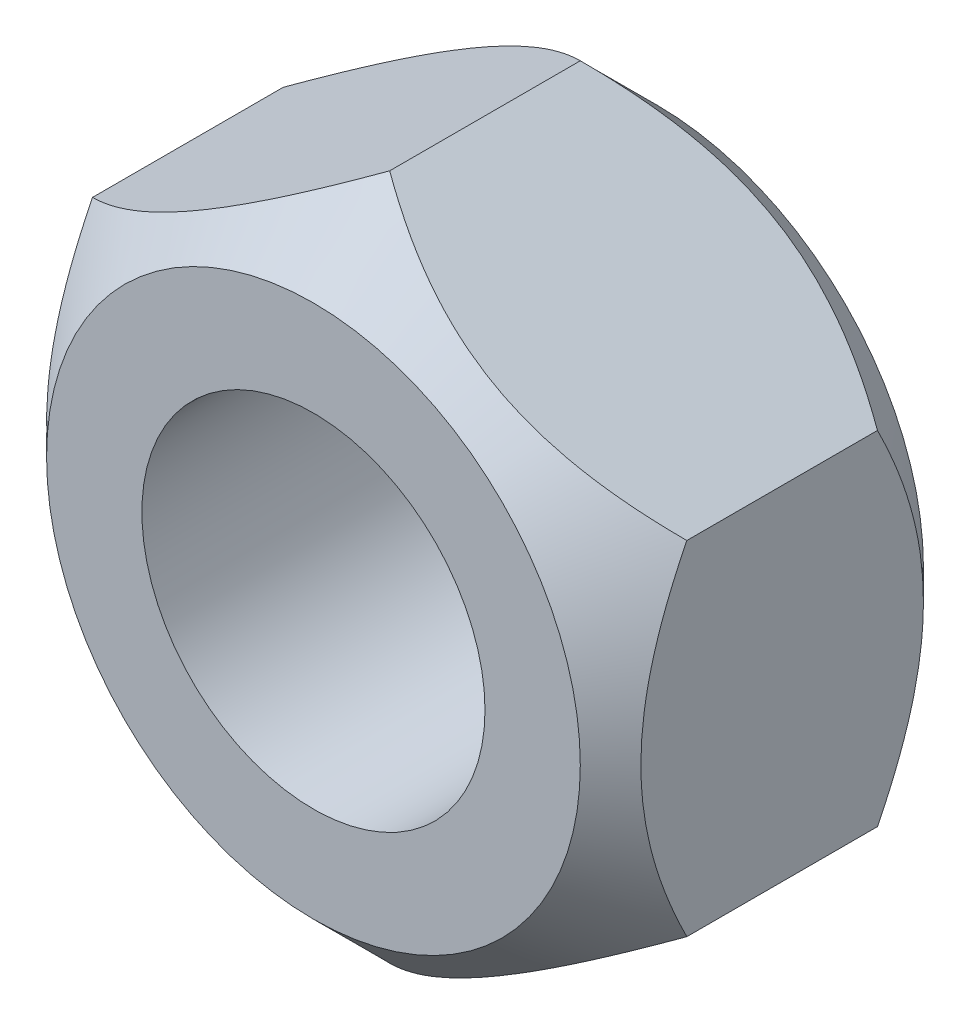
ISO-10303-21;
HEADER;
FILE_DESCRIPTION(('STEP AP214'),'2;1');
FILE_NAME('part.step','',(''),(''),'','','');
FILE_SCHEMA(('AUTOMOTIVE_DESIGN { 1 0 10303 214 1 1 1 1 }'));
ENDSEC;
DATA;
#1=APPLICATION_CONTEXT('core data for automotive mechanical design processes');
#2=APPLICATION_PROTOCOL_DEFINITION('international standard','automotive_design',2000,#1);
#3=PRODUCT_CONTEXT('',#1,'mechanical');
#4=PRODUCT('Part','Part','',(#3));
#5=PRODUCT_RELATED_PRODUCT_CATEGORY('part','',(#4));
#6=PRODUCT_DEFINITION_FORMATION('','',#4);
#7=PRODUCT_DEFINITION_CONTEXT('part definition',#1,'design');
#8=PRODUCT_DEFINITION('design','',#6,#7);
#9=PRODUCT_DEFINITION_SHAPE('','',#8);
#10=(LENGTH_UNIT() NAMED_UNIT(*) SI_UNIT(.MILLI.,.METRE.));
#11=(NAMED_UNIT(*) PLANE_ANGLE_UNIT() SI_UNIT($,.RADIAN.));
#12=(NAMED_UNIT(*) SI_UNIT($,.STERADIAN.) SOLID_ANGLE_UNIT());
#13=UNCERTAINTY_MEASURE_WITH_UNIT(LENGTH_MEASURE(1.E-05),#10,'distance_accuracy_value','');
#14=(GEOMETRIC_REPRESENTATION_CONTEXT(3) GLOBAL_UNCERTAINTY_ASSIGNED_CONTEXT((#13)) GLOBAL_UNIT_ASSIGNED_CONTEXT((#10,
#11,#12)) REPRESENTATION_CONTEXT('',''));
#15=CARTESIAN_POINT('',(0.,0.,0.));
#16=DIRECTION('',(0.,0.,1.));
#17=DIRECTION('',(1.,0.,0.));
#18=AXIS2_PLACEMENT_3D('',#15,#16,#17);
#19=CARTESIAN_POINT('',(0.,0.,-4.5));
#20=DIRECTION('',(0.,0.,1.));
#21=DIRECTION('',(1.,0.,0.));
#22=AXIS2_PLACEMENT_3D('',#19,#20,#21);
#23=PLANE('',#22);
#24=CARTESIAN_POINT('',(0.,0.,-4.5));
#25=DIRECTION('',(0.,0.,1.));
#26=DIRECTION('',(1.,0.,0.));
#27=AXIS2_PLACEMENT_3D('',#24,#25,#26);
#28=CIRCLE('',#27,4.5);
#29=CARTESIAN_POINT('',(4.5,0.,-4.5));
#30=VERTEX_POINT('',#29);
#31=EDGE_CURVE('E206',#30,#30,#28,.T.);
#32=ORIENTED_EDGE('',*,*,#31,.T.);
#33=EDGE_LOOP('',(#32));
#34=FACE_BOUND('',#33,.T.);
#35=CARTESIAN_POINT('',(0.,0.,-4.5));
#36=DIRECTION('',(0.,0.,1.));
#37=DIRECTION('',(1.,0.,0.));
#38=AXIS2_PLACEMENT_3D('',#35,#36,#37);
#39=CIRCLE('',#38,7.);
#40=CARTESIAN_POINT('',(7.,0.,-4.5));
#41=VERTEX_POINT('',#40);
#42=EDGE_CURVE('E99',#41,#41,#39,.T.);
#43=ORIENTED_EDGE('',*,*,#42,.F.);
#44=EDGE_LOOP('',(#43));
#45=FACE_BOUND('',#44,.T.);
#46=ADVANCED_FACE('F35',(#34,#45),#23,.F.);
#47=CARTESIAN_POINT('',(0.,0.,4.5));
#48=DIRECTION('',(0.,0.,1.));
#49=DIRECTION('',(1.,0.,0.));
#50=AXIS2_PLACEMENT_3D('',#47,#48,#49);
#51=PLANE('',#50);
#52=CARTESIAN_POINT('',(0.,0.,4.5));
#53=DIRECTION('',(0.,0.,1.));
#54=DIRECTION('',(1.,0.,0.));
#55=AXIS2_PLACEMENT_3D('',#52,#53,#54);
#56=CIRCLE('',#55,4.5);
#57=CARTESIAN_POINT('',(4.5,0.,4.5));
#58=VERTEX_POINT('',#57);
#59=EDGE_CURVE('E115',#58,#58,#56,.T.);
#60=ORIENTED_EDGE('',*,*,#59,.F.);
#61=EDGE_LOOP('',(#60));
#62=FACE_BOUND('',#61,.T.);
#63=CARTESIAN_POINT('',(0.,0.,4.5));
#64=DIRECTION('',(0.,0.,1.));
#65=DIRECTION('',(1.,0.,0.));
#66=AXIS2_PLACEMENT_3D('',#63,#64,#65);
#67=CIRCLE('',#66,7.);
#68=CARTESIAN_POINT('',(7.,0.,4.5));
#69=VERTEX_POINT('',#68);
#70=EDGE_CURVE('E135',#69,#69,#67,.T.);
#71=ORIENTED_EDGE('',*,*,#70,.T.);
#72=EDGE_LOOP('',(#71));
#73=FACE_BOUND('',#72,.T.);
#74=ADVANCED_FACE('F223',(#62,#73),#51,.T.);
#75=CARTESIAN_POINT('',(0.,-9.,4.5));
#76=DIRECTION('',(-0.5,0.866025403784439,0.));
#77=DIRECTION('',(-0.866025403784439,-0.5,0.));
#78=AXIS2_PLACEMENT_3D('',#75,#76,#77);
#79=PLANE('',#78);
#80=DIRECTION('',(0.,0.,-1.));
#81=VECTOR('',#80,1.);
#82=CARTESIAN_POINT('',(0.,-9.,4.5));
#83=LINE('',#82,#81);
#84=CARTESIAN_POINT('',(0.,-9.,2.50000000000001));
#85=VERTEX_POINT('',#84);
#86=CARTESIAN_POINT('',(0.,-9.,-2.50000000000001));
#87=VERTEX_POINT('',#86);
#88=EDGE_CURVE('E111',#85,#87,#83,.T.);
#89=ORIENTED_EDGE('',*,*,#88,.T.);
#90=CARTESIAN_POINT('',(-0.000200000000004424,-9.00011547005384,-2.49988452772398));
#91=CARTESIAN_POINT('',(0.133814912829303,-8.92274192405641,-2.57724943822116));
#92=CARTESIAN_POINT('',(0.268859920219695,-8.84477365268685,-2.65224010470585));
#93=CARTESIAN_POINT('',(0.541212204700916,-8.68753098792721,-2.79675072757461));
#94=CARTESIAN_POINT('',(0.678520668512916,-8.60825590938334,-2.8662676961683));
#95=CARTESIAN_POINT('',(1.09541992231467,-8.36755901297594,-3.06611750189364));
#96=CARTESIAN_POINT('',(1.37853991488369,-8.20409960905325,-3.18689671096131));
#97=CARTESIAN_POINT('',(1.94947397801178,-7.87447067401672,-3.39372263743866));
#98=CARTESIAN_POINT('',(2.23714213096899,-7.7083853884696,-3.48029040430474));
#99=CARTESIAN_POINT('',(2.67337358843079,-7.45652703907504,-3.58042793344483));
#100=CARTESIAN_POINT('',(2.81942630960118,-7.37220346119144,-3.60884136548566));
#101=CARTESIAN_POINT('',(3.11276835521759,-7.20284235219017,-3.65512056900799));
#102=CARTESIAN_POINT('',(3.26005749153017,-7.1178049296914,-3.67298791670453));
#103=CARTESIAN_POINT('',(3.61898351870672,-6.91057889128185,-3.70294525162354));
#104=CARTESIAN_POINT('',(3.83100714223217,-6.78816699516487,-3.70923068335258));
#105=CARTESIAN_POINT('',(4.25467221995019,-6.54356384849813,-3.69867971969579));
#106=CARTESIAN_POINT('',(4.46631351414594,-6.42137269032257,-3.68183521936724));
#107=CARTESIAN_POINT('',(4.88760075151282,-6.17814239042265,-3.62601731093405));
#108=CARTESIAN_POINT('',(5.09724419637851,-6.05710469109561,-3.58701915721181));
#109=CARTESIAN_POINT('',(5.5129278162872,-5.81710964124361,-3.48901412107609));
#110=CARTESIAN_POINT('',(5.718968266362,-5.69815213192897,-3.43000877296915));
#111=CARTESIAN_POINT('',(6.08472164618569,-5.48698431963075,-3.3086185274243));
#112=CARTESIAN_POINT('',(6.24524456927916,-5.39430636677162,-3.24942654058235));
#113=CARTESIAN_POINT('',(6.56340893558358,-5.21061408423922,-3.12150426182083));
#114=CARTESIAN_POINT('',(6.72105029135445,-5.11959980504949,-3.05277368099819));
#115=CARTESIAN_POINT('',(7.03295499774781,-4.93952153885177,-2.90731482672895));
#116=CARTESIAN_POINT('',(7.18722721899938,-4.8504524303837,-2.83061170476549));
#117=CARTESIAN_POINT('',(7.49291506794184,-4.67396346850877,-2.67021472494556));
#118=CARTESIAN_POINT('',(7.64433237841887,-4.58654264354489,-2.58652515379038));
#119=CARTESIAN_POINT('',(7.79442863405994,-4.49988452994616,-2.49988452772398));
#120=B_SPLINE_CURVE_WITH_KNOTS('',3,(#90,#91,#92,#93,#94,#95,#96,#97,#98,#99,#100,#101,#102,
#103,#104,#105,#106,#107,#108,#109,#110,#111,#112,#113,#114,#115,#116,#117,#118,#119),
.UNSPECIFIED.,.F.,.F.,(4,2,2,2,2,2,2,2,2,2,2,2,2,2,4),(0.,0.518995570787867,1.03827249662172,
2.08243235310214,3.11001247476867,3.62279481108642,4.13550048766921,4.86907230716034,
5.60290124262732,6.33755148088632,7.07214539321498,7.65560480846296,8.23908189927372,
8.82077112592717,9.40210603032025),.UNSPECIFIED.);
#121=CARTESIAN_POINT('',(7.79422863405995,-4.5,-2.50000000000001));
#122=VERTEX_POINT('',#121);
#123=EDGE_CURVE('E56',#87,#122,#120,.T.);
#124=ORIENTED_EDGE('',*,*,#123,.T.);
#125=DIRECTION('',(0.,0.,-1.));
#126=VECTOR('',#125,1.);
#127=CARTESIAN_POINT('',(7.79422863405995,-4.5,4.5));
#128=LINE('',#127,#126);
#129=CARTESIAN_POINT('',(7.79422863405995,-4.5,2.50000000000001));
#130=VERTEX_POINT('',#129);
#131=EDGE_CURVE('E49',#130,#122,#128,.T.);
#132=ORIENTED_EDGE('',*,*,#131,.F.);
#133=CARTESIAN_POINT('',(-0.000200000000004337,-9.00011547005384,2.49988452772398));
#134=CARTESIAN_POINT('',(0.133814912829303,-8.92274192405641,2.57724943822116));
#135=CARTESIAN_POINT('',(0.268859920219695,-8.84477365268685,2.65224010470585));
#136=CARTESIAN_POINT('',(0.541212204700916,-8.68753098792721,2.79675072757461));
#137=CARTESIAN_POINT('',(0.678520668512916,-8.60825590938334,2.8662676961683));
#138=CARTESIAN_POINT('',(1.09541992231467,-8.36755901297594,3.06611750189364));
#139=CARTESIAN_POINT('',(1.37853991488369,-8.20409960905325,3.18689671096131));
#140=CARTESIAN_POINT('',(1.94947397801178,-7.87447067401672,3.39372263743866));
#141=CARTESIAN_POINT('',(2.23714213096899,-7.7083853884696,3.48029040430474));
#142=CARTESIAN_POINT('',(2.67337358843079,-7.45652703907504,3.58042793344483));
#143=CARTESIAN_POINT('',(2.81942630960118,-7.37220346119144,3.60884136548566));
#144=CARTESIAN_POINT('',(3.11276835521759,-7.20284235219017,3.65512056900799));
#145=CARTESIAN_POINT('',(3.26005749153017,-7.1178049296914,3.67298791670453));
#146=CARTESIAN_POINT('',(3.61898351870672,-6.91057889128185,3.70294525162354));
#147=CARTESIAN_POINT('',(3.83100714223217,-6.78816699516487,3.70923068335258));
#148=CARTESIAN_POINT('',(4.25467221995019,-6.54356384849813,3.69867971969579));
#149=CARTESIAN_POINT('',(4.46631351414594,-6.42137269032258,3.68183521936724));
#150=CARTESIAN_POINT('',(4.88760075151282,-6.17814239042265,3.62601731093405));
#151=CARTESIAN_POINT('',(5.0972441963785,-6.05710469109561,3.58701915721182));
#152=CARTESIAN_POINT('',(5.5129278162872,-5.81710964124361,3.48901412107609));
#153=CARTESIAN_POINT('',(5.718968266362,-5.69815213192897,3.43000877296915));
#154=CARTESIAN_POINT('',(6.08472164618568,-5.48698431963075,3.3086185274243));
#155=CARTESIAN_POINT('',(6.24524456927916,-5.39430636677163,3.24942654058235));
#156=CARTESIAN_POINT('',(6.56340893558358,-5.21061408423922,3.12150426182083));
#157=CARTESIAN_POINT('',(6.72105029135445,-5.11959980504949,3.05277368099819));
#158=CARTESIAN_POINT('',(7.03295499774781,-4.93952153885178,2.90731482672895));
#159=CARTESIAN_POINT('',(7.18722721899938,-4.8504524303837,2.83061170476549));
#160=CARTESIAN_POINT('',(7.49291506794184,-4.67396346850877,2.67021472494557));
#161=CARTESIAN_POINT('',(7.64433237841887,-4.58654264354489,2.58652515379038));
#162=CARTESIAN_POINT('',(7.79442863405994,-4.49988452994616,2.49988452772398));
#163=B_SPLINE_CURVE_WITH_KNOTS('',3,(#133,#134,#135,#136,#137,#138,#139,#140,#141,#142,#143,
#144,#145,#146,#147,#148,#149,#150,#151,#152,#153,#154,#155,#156,#157,#158,#159,#160,#161,#162),
.UNSPECIFIED.,.F.,.F.,(4,2,2,2,2,2,2,2,2,2,2,2,2,2,4),(0.,0.518995570787867,1.03827249662172,
2.08243235310213,3.11001247476867,3.62279481108641,4.13550048766921,4.86907230716034,
5.60290124262732,6.33755148088631,7.07214539321497,7.65560480846295,8.23908189927372,
8.82077112592717,9.40210603032024),.UNSPECIFIED.);
#164=EDGE_CURVE('E134',#85,#130,#163,.T.);
#165=ORIENTED_EDGE('',*,*,#164,.F.);
#166=EDGE_LOOP('',(#89,#124,#132,#165));
#167=FACE_BOUND('',#166,.T.);
#168=ADVANCED_FACE('F37',(#167),#79,.F.);
#169=CARTESIAN_POINT('',(7.79422863405995,-4.5,4.5));
#170=DIRECTION('',(-1.,0.,0.));
#171=DIRECTION('',(0.,0.,1.));
#172=AXIS2_PLACEMENT_3D('',#169,#170,#171);
#173=PLANE('',#172);
#174=ORIENTED_EDGE('',*,*,#131,.T.);
#175=CARTESIAN_POINT('',(7.79422863405995,-9.09394715547472,0.477056185330612));
#176=CARTESIAN_POINT('',(7.79422863405995,-8.87304824034257,0.309369922337286));
#177=CARTESIAN_POINT('',(7.79422863405995,-8.65092594028398,0.143269304135814));
#178=CARTESIAN_POINT('',(7.79422863405995,-8.2037468853519,-0.185046465831498));
#179=CARTESIAN_POINT('',(7.79422863405995,-7.9786894198651,-0.347260648660207));
#180=CARTESIAN_POINT('',(7.79422863405995,-7.52350587516484,-0.668243492062624));
#181=CARTESIAN_POINT('',(7.79422863405995,-7.29335404542553,-0.826975758505599));
#182=CARTESIAN_POINT('',(7.79422863405995,-6.82916491800423,-1.13863473603327));
#183=CARTESIAN_POINT('',(7.79422863405995,-6.59512789431531,-1.29156185403188));
#184=CARTESIAN_POINT('',(7.79422863405995,-6.10861356811196,-1.59911373195837));
#185=CARTESIAN_POINT('',(7.79422863405995,-5.85586236287458,-1.75330739987037));
#186=CARTESIAN_POINT('',(7.79422863405995,-5.34444805225407,-2.05172051396913));
#187=CARTESIAN_POINT('',(7.79422863405995,-5.0857840022399,-2.19593835139815));
#188=CARTESIAN_POINT('',(7.79422863405995,-4.56254060285832,-2.47129952018685));
#189=CARTESIAN_POINT('',(7.79422863405995,-4.29798164154792,-2.60248128979954));
#190=CARTESIAN_POINT('',(7.79422863405995,-3.76157041279732,-2.84883273993489));
#191=CARTESIAN_POINT('',(7.79422863405995,-3.48972155704628,-2.96400975992128));
#192=CARTESIAN_POINT('',(7.79422863405995,-2.96195558134773,-3.16519743759073));
#193=CARTESIAN_POINT('',(7.79422863405995,-2.70667616130689,-3.2528637124236));
#194=CARTESIAN_POINT('',(7.79422863405995,-2.18986711745022,-3.40773189086697));
#195=CARTESIAN_POINT('',(7.79422863405995,-1.92833707431502,-3.47493241736553));
#196=CARTESIAN_POINT('',(7.79422863405995,-1.40499627685955,-3.58420542834552));
#197=CARTESIAN_POINT('',(7.79422863405995,-1.14327848116194,-3.62671579796499));
#198=CARTESIAN_POINT('',(7.79422863405995,-0.616913524311271,-3.68576445338113));
#199=CARTESIAN_POINT('',(7.79422863405995,-0.352266903985001,-3.7023074562197));
#200=CARTESIAN_POINT('',(7.79422863405995,0.167194170703069,-3.70813991339629));
#201=CARTESIAN_POINT('',(7.79422863405995,0.421997492259029,-3.69844765895442));
#202=CARTESIAN_POINT('',(7.79422863405995,0.929479250449245,-3.65462007372973));
#203=CARTESIAN_POINT('',(7.79422863405995,1.1821574819346,-3.62048240986263));
#204=CARTESIAN_POINT('',(7.79422863405995,1.6878345517575,-3.52906544661772));
#205=CARTESIAN_POINT('',(7.79422863405995,1.94076025751878,-3.47138813734577));
#206=CARTESIAN_POINT('',(7.79422863405995,2.44108523216263,-3.33600336789197));
#207=CARTESIAN_POINT('',(7.79422863405995,2.68848492023637,-3.25829743268213));
#208=CARTESIAN_POINT('',(7.79422863405995,3.19749234060817,-3.07903876024062));
#209=CARTESIAN_POINT('',(7.79422863405995,3.45858810167663,-2.97604743571423));
#210=CARTESIAN_POINT('',(7.79422863405995,3.97401946723936,-2.7542202202052));
#211=CARTESIAN_POINT('',(7.79422863405995,4.22835188870413,-2.6353770217755));
#212=CARTESIAN_POINT('',(7.79422863405995,4.73148608186761,-2.38467036528707));
#213=CARTESIAN_POINT('',(7.79422863405995,4.98026743549242,-2.25276626146364));
#214=CARTESIAN_POINT('',(7.79422863405995,5.47211299031114,-1.97884924330837));
#215=CARTESIAN_POINT('',(7.79422863405995,5.71517808362128,-1.83683792049101));
#216=CARTESIAN_POINT('',(7.79422863405995,6.18440751626233,-1.55193963216556));
#217=CARTESIAN_POINT('',(7.79422863405995,6.41081191650821,-1.40944596144392));
#218=CARTESIAN_POINT('',(7.79422863405995,6.85973281578872,-1.11844233782494));
#219=CARTESIAN_POINT('',(7.79422863405995,7.08224901939772,-0.969931930595725));
#220=CARTESIAN_POINT('',(7.79422863405995,7.52210265451289,-0.66919058507346));
#221=CARTESIAN_POINT('',(7.79422863405995,7.73946742483206,-0.516999488151345));
#222=CARTESIAN_POINT('',(7.79422863405995,8.17122258952744,-0.208574446056027));
#223=CARTESIAN_POINT('',(7.79422863405995,8.38561378614921,-0.0523416252313317));
#224=CARTESIAN_POINT('',(7.79422863405995,8.59875908665108,0.105544271177639));
#225=B_SPLINE_CURVE_WITH_KNOTS('',3,(#175,#176,#177,#178,#179,#180,#181,#182,#183,#184,#185,
#186,#187,#188,#189,#190,#191,#192,#193,#194,#195,#196,#197,#198,#199,#200,#201,#202,#203,#204,
#205,#206,#207,#208,#209,#210,#211,#212,#213,#214,#215,#216,#217,#218,#219,#220,#221,#222,#223,
#224),.UNSPECIFIED.,.F.,.F.,(4,2,2,2,2,2,2,2,2,2,2,2,2,2,2,2,2,2,2,2,2,2,2,2,4),(0.,
0.832022793264551,1.66425090601205,2.50292157170978,3.34153334152934,4.22956744022142,
5.11774441594441,6.0032195454111,6.88828726377758,7.69731860709993,8.50640437700199,
9.30066436115751,10.0947800491506,10.8585193930986,11.6223316384961,12.3996319486262,
13.1768730928778,14.0182445381844,14.8600051907364,15.7044730667065,16.5488082630534,
17.3512366611706,18.1537257650846,18.9497197770996,19.7454946871066),.UNSPECIFIED.);
#226=CARTESIAN_POINT('',(7.79422863405995,4.5,-2.50000000000001));
#227=VERTEX_POINT('',#226);
#228=EDGE_CURVE('E130',#122,#227,#225,.T.);
#229=ORIENTED_EDGE('',*,*,#228,.T.);
#230=DIRECTION('',(0.,0.,-1.));
#231=VECTOR('',#230,1.);
#232=CARTESIAN_POINT('',(7.79422863405995,4.5,4.5));
#233=LINE('',#232,#231);
#234=CARTESIAN_POINT('',(7.79422863405995,4.5,2.50000000000001));
#235=VERTEX_POINT('',#234);
#236=EDGE_CURVE('E121',#235,#227,#233,.T.);
#237=ORIENTED_EDGE('',*,*,#236,.F.);
#238=CARTESIAN_POINT('',(7.79422863405995,-9.11863627866827,-0.49581291879149));
#239=CARTESIAN_POINT('',(7.79422863405995,-8.89724376305625,-0.327559158709732));
#240=CARTESIAN_POINT('',(7.79422863405995,-8.67462790699453,-0.160889222300111));
#241=CARTESIAN_POINT('',(7.79422863405995,-8.22646080065647,0.168568779647738));
#242=CARTESIAN_POINT('',(7.79422863405995,-8.00090884202403,0.331355880550955));
#243=CARTESIAN_POINT('',(7.79422863405995,-7.54473075560588,0.653492298004572));
#244=CARTESIAN_POINT('',(7.79422863405995,-7.31407886663682,0.812805256213386));
#245=CARTESIAN_POINT('',(7.79422863405995,-6.84888563683663,1.12562871650273));
#246=CARTESIAN_POINT('',(7.79422863405995,-6.6143445698453,1.27913962463481));
#247=CARTESIAN_POINT('',(7.79422863405995,-6.12669801100064,1.5879508601926));
#248=CARTESIAN_POINT('',(7.79422863405995,-5.87331643820808,1.7428174306828));
#249=CARTESIAN_POINT('',(7.79422863405995,-5.36062431926778,2.04256769064756));
#250=CARTESIAN_POINT('',(7.79422863405995,-5.10131282234181,2.18744976409159));
#251=CARTESIAN_POINT('',(7.79422863405995,-4.57675177345508,2.46411886174421));
#252=CARTESIAN_POINT('',(7.79422863405995,-4.31152268558148,2.59594438187719));
#253=CARTESIAN_POINT('',(7.79422863405995,-3.77373677628115,2.84354820712139));
#254=CARTESIAN_POINT('',(7.79422863405995,-3.50118339127063,2.95933388611422));
#255=CARTESIAN_POINT('',(7.79422863405995,-2.97232992335846,3.16151116397044));
#256=CARTESIAN_POINT('',(7.79422863405995,-2.71667916441184,3.24958378601871));
#257=CARTESIAN_POINT('',(7.79422863405995,-2.19909692605669,3.40523788735144));
#258=CARTESIAN_POINT('',(7.79422863405995,-1.93716502727825,3.47281799428829));
#259=CARTESIAN_POINT('',(7.79422863405995,-1.41301128174397,3.58278938552872));
#260=CARTESIAN_POINT('',(7.79422863405995,-1.15088339820741,3.62562114650901));
#261=CARTESIAN_POINT('',(7.79422863405995,-0.623666543696004,3.68524160940488));
#262=CARTESIAN_POINT('',(7.79422863405995,-0.358578125624287,3.70203509488474));
#263=CARTESIAN_POINT('',(7.79422863405995,0.161655582537087,3.70826718171898));
#264=CARTESIAN_POINT('',(7.79422863405995,0.416788791328765,3.69873892078228));
#265=CARTESIAN_POINT('',(7.79422863405995,0.924939337840435,3.65516781717527));
#266=CARTESIAN_POINT('',(7.79422863405995,1.17795647205576,3.62112264350477));
#267=CARTESIAN_POINT('',(7.79422863405995,1.68432417774725,3.52981967956849));
#268=CARTESIAN_POINT('',(7.79422863405995,1.93760141924557,3.47216178368508));
#269=CARTESIAN_POINT('',(7.79422863405995,2.43861843577759,3.33675115618934));
#270=CARTESIAN_POINT('',(7.79422863405995,2.68635862216585,3.25899992276302));
#271=CARTESIAN_POINT('',(7.79422863405995,3.19552545298942,3.07978118806223));
#272=CARTESIAN_POINT('',(7.79422863405995,3.45645287453228,2.97691027579791));
#273=CARTESIAN_POINT('',(7.79422863405995,3.97155614606763,2.75533602046274));
#274=CARTESIAN_POINT('',(7.79422863405995,4.22572882355011,2.63662539018871));
#275=CARTESIAN_POINT('',(7.79422863405995,4.72854871011536,2.38619224839543));
#276=CARTESIAN_POINT('',(7.79422863405995,4.97717554762213,2.25442916490132));
#277=CARTESIAN_POINT('',(7.79422863405995,5.46871717061556,1.98079866286188));
#278=CARTESIAN_POINT('',(7.79422863405995,5.71163284564515,1.83893283192657));
#279=CARTESIAN_POINT('',(7.79422863405995,6.18058060030463,1.55431707414972));
#280=CARTESIAN_POINT('',(7.79422863405995,6.40685244588674,1.41196011259217));
#281=CARTESIAN_POINT('',(7.79422863405995,6.85551031235278,1.12123100261908));
#282=CARTESIAN_POINT('',(7.79422863405995,7.07789603815161,0.972858400233066));
#283=CARTESIAN_POINT('',(7.79422863405995,7.51749251053286,0.672391168670841));
#284=CARTESIAN_POINT('',(7.79422863405995,7.73473056455643,0.520336348130769));
#285=CARTESIAN_POINT('',(7.79422863405995,8.1662332947553,0.212183967746507));
#286=CARTESIAN_POINT('',(7.79422863405995,8.38049877304376,0.0560875324024104));
#287=CARTESIAN_POINT('',(7.79422863405995,8.59351863403874,-0.101662058238496));
#288=B_SPLINE_CURVE_WITH_KNOTS('',3,(#238,#239,#240,#241,#242,#243,#244,#245,#246,#247,#248,
#249,#250,#251,#252,#253,#254,#255,#256,#257,#258,#259,#260,#261,#262,#263,#264,#265,#266,#267,
#268,#269,#270,#271,#272,#273,#274,#275,#276,#277,#278,#279,#280,#281,#282,#283,#284,#285,#286,
#287),.UNSPECIFIED.,.F.,.F.,(4,2,2,2,2,2,2,2,2,2,2,2,2,2,2,2,2,2,2,2,2,2,2,2,4),(0.,
0.834231738401029,1.66866861543129,2.5095637126134,3.35039985108581,4.24110012959546,
5.13194423453569,6.02007828309381,6.90780267146998,7.71828351476771,8.52881862255801,
9.32444408797799,10.1199233694967,10.8846281318961,11.6494056099085,12.4277164632134,
13.205969301359,14.0467395241653,14.8878978931083,15.7317582373753,16.5754862634477,
17.3773596551058,18.1792936732027,18.9747417826645,19.7699709033892),.UNSPECIFIED.);
#289=EDGE_CURVE('E131',#130,#235,#288,.T.);
#290=ORIENTED_EDGE('',*,*,#289,.F.);
#291=EDGE_LOOP('',(#174,#229,#237,#290));
#292=FACE_BOUND('',#291,.T.);
#293=ADVANCED_FACE('F128',(#292),#173,.F.);
#294=CARTESIAN_POINT('',(7.79422863405995,4.5,4.5));
#295=DIRECTION('',(-0.5,-0.866025403784439,0.));
#296=DIRECTION('',(0.866025403784439,-0.5,0.));
#297=AXIS2_PLACEMENT_3D('',#294,#295,#296);
#298=PLANE('',#297);
#299=ORIENTED_EDGE('',*,*,#236,.T.);
#300=CARTESIAN_POINT('',(7.79442863405995,4.49988452994616,-2.49988452772398));
#301=CARTESIAN_POINT('',(7.66041372123064,4.57725807594359,-2.57724943822116));
#302=CARTESIAN_POINT('',(7.52536871384025,4.65522634731315,-2.65224010470585));
#303=CARTESIAN_POINT('',(7.25301642935903,4.81246901207279,-2.79675072757461));
#304=CARTESIAN_POINT('',(7.11570796554703,4.89174409061666,-2.8662676961683));
#305=CARTESIAN_POINT('',(6.69880871174527,5.13244098702406,-3.06611750189364));
#306=CARTESIAN_POINT('',(6.41568871917625,5.29590039094675,-3.18689671096131));
#307=CARTESIAN_POINT('',(5.84475465604816,5.62552932598328,-3.39372263743866));
#308=CARTESIAN_POINT('',(5.55708650309095,5.79161461153041,-3.48029040430474));
#309=CARTESIAN_POINT('',(5.12085504562915,6.04347296092496,-3.58042793344483));
#310=CARTESIAN_POINT('',(4.97480232445876,6.12779653880856,-3.60884136548566));
#311=CARTESIAN_POINT('',(4.68146027884235,6.29715764780983,-3.65512056900799));
#312=CARTESIAN_POINT('',(4.53417114252977,6.38219507030861,-3.67298791670453));
#313=CARTESIAN_POINT('',(4.17524511535322,6.58942110871815,-3.70294525162354));
#314=CARTESIAN_POINT('',(3.96322149182777,6.71183300483513,-3.70923068335258));
#315=CARTESIAN_POINT('',(3.53955641410975,6.95643615150187,-3.69867971969579));
#316=CARTESIAN_POINT('',(3.327915119914,7.07862730967743,-3.68183521936724));
#317=CARTESIAN_POINT('',(2.90662788254712,7.32185760957735,-3.62601731093404));
#318=CARTESIAN_POINT('',(2.69698443768143,7.44289530890439,-3.58701915721181));
#319=CARTESIAN_POINT('',(2.28130081777274,7.6828903587564,-3.48901412107608));
#320=CARTESIAN_POINT('',(2.07526036769793,7.80184786807104,-3.43000877296914));
#321=CARTESIAN_POINT('',(1.70950698787425,8.01301568036926,-3.30861852742429));
#322=CARTESIAN_POINT('',(1.54898406478078,8.10569363322838,-3.24942654058234));
#323=CARTESIAN_POINT('',(1.23081969847636,8.28938591576078,-3.12150426182083));
#324=CARTESIAN_POINT('',(1.07317834270549,8.38040019495051,-3.05277368099818));
#325=CARTESIAN_POINT('',(0.76127363631213,8.56047846114823,-2.90731482672894));
#326=CARTESIAN_POINT('',(0.607001415060562,8.6495475696163,-2.83061170476548));
#327=CARTESIAN_POINT('',(0.301313566118107,8.82603653149123,-2.67021472494556));
#328=CARTESIAN_POINT('',(0.149896255641076,8.91345735645511,-2.58652515379037));
#329=CARTESIAN_POINT('',(-0.000199999999998226,9.00011547005384,-2.49988452772397));
#330=B_SPLINE_CURVE_WITH_KNOTS('',3,(#300,#301,#302,#303,#304,#305,#306,#307,#308,#309,#310,
#311,#312,#313,#314,#315,#316,#317,#318,#319,#320,#321,#322,#323,#324,#325,#326,#327,#328,#329),
.UNSPECIFIED.,.F.,.F.,(4,2,2,2,2,2,2,2,2,2,2,2,2,2,4),(0.,0.518995570787867,1.03827249662172,
2.08243235310214,3.11001247476867,3.62279481108642,4.13550048766921,4.86907230716034,
5.60290124262733,6.33755148088632,7.07214539321498,7.65560480846296,8.23908189927372,
8.82077112592717,9.40210603032024),.UNSPECIFIED.);
#331=CARTESIAN_POINT('',(0.,9.,-2.50000000000001));
#332=VERTEX_POINT('',#331);
#333=EDGE_CURVE('E139',#227,#332,#330,.T.);
#334=ORIENTED_EDGE('',*,*,#333,.T.);
#335=DIRECTION('',(0.,0.,-1.));
#336=VECTOR('',#335,1.);
#337=CARTESIAN_POINT('',(0.,9.,4.5));
#338=LINE('',#337,#336);
#339=CARTESIAN_POINT('',(0.,9.,2.50000000000001));
#340=VERTEX_POINT('',#339);
#341=EDGE_CURVE('E113',#340,#332,#338,.T.);
#342=ORIENTED_EDGE('',*,*,#341,.F.);
#343=CARTESIAN_POINT('',(7.79442863405995,4.49988452994616,2.49988452772398));
#344=CARTESIAN_POINT('',(7.66041372123064,4.57725807594359,2.57724943822116));
#345=CARTESIAN_POINT('',(7.52536871384025,4.65522634731315,2.65224010470585));
#346=CARTESIAN_POINT('',(7.25301642935903,4.81246901207279,2.79675072757461));
#347=CARTESIAN_POINT('',(7.11570796554703,4.89174409061666,2.8662676961683));
#348=CARTESIAN_POINT('',(6.69880871174527,5.13244098702406,3.06611750189364));
#349=CARTESIAN_POINT('',(6.41568871917625,5.29590039094675,3.18689671096131));
#350=CARTESIAN_POINT('',(5.84475465604816,5.62552932598328,3.39372263743866));
#351=CARTESIAN_POINT('',(5.55708650309095,5.79161461153041,3.48029040430474));
#352=CARTESIAN_POINT('',(5.12085504562915,6.04347296092496,3.58042793344483));
#353=CARTESIAN_POINT('',(4.97480232445876,6.12779653880856,3.60884136548566));
#354=CARTESIAN_POINT('',(4.68146027884235,6.29715764780983,3.65512056900799));
#355=CARTESIAN_POINT('',(4.53417114252977,6.38219507030861,3.67298791670453));
#356=CARTESIAN_POINT('',(4.17524511535322,6.58942110871815,3.70294525162354));
#357=CARTESIAN_POINT('',(3.96322149182777,6.71183300483513,3.70923068335258));
#358=CARTESIAN_POINT('',(3.53955641410975,6.95643615150187,3.69867971969579));
#359=CARTESIAN_POINT('',(3.327915119914,7.07862730967743,3.68183521936724));
#360=CARTESIAN_POINT('',(2.90662788254712,7.32185760957735,3.62601731093404));
#361=CARTESIAN_POINT('',(2.69698443768143,7.44289530890439,3.58701915721181));
#362=CARTESIAN_POINT('',(2.28130081777274,7.6828903587564,3.48901412107608));
#363=CARTESIAN_POINT('',(2.07526036769793,7.80184786807104,3.43000877296914));
#364=CARTESIAN_POINT('',(1.70950698787425,8.01301568036926,3.30861852742429));
#365=CARTESIAN_POINT('',(1.54898406478078,8.10569363322838,3.24942654058234));
#366=CARTESIAN_POINT('',(1.23081969847636,8.28938591576078,3.12150426182083));
#367=CARTESIAN_POINT('',(1.07317834270549,8.38040019495051,3.05277368099818));
#368=CARTESIAN_POINT('',(0.76127363631213,8.56047846114823,2.90731482672894));
#369=CARTESIAN_POINT('',(0.607001415060562,8.6495475696163,2.83061170476548));
#370=CARTESIAN_POINT('',(0.301313566118107,8.82603653149123,2.67021472494556));
#371=CARTESIAN_POINT('',(0.149896255641076,8.91345735645511,2.58652515379037));
#372=CARTESIAN_POINT('',(-0.000199999999998226,9.00011547005384,2.49988452772397));
#373=B_SPLINE_CURVE_WITH_KNOTS('',3,(#343,#344,#345,#346,#347,#348,#349,#350,#351,#352,#353,
#354,#355,#356,#357,#358,#359,#360,#361,#362,#363,#364,#365,#366,#367,#368,#369,#370,#371,#372),
.UNSPECIFIED.,.F.,.F.,(4,2,2,2,2,2,2,2,2,2,2,2,2,2,4),(0.,0.518995570787867,1.03827249662172,
2.08243235310214,3.11001247476867,3.62279481108642,4.13550048766921,4.86907230716034,
5.60290124262733,6.33755148088632,7.07214539321498,7.65560480846296,8.23908189927372,
8.82077112592717,9.40210603032024),.UNSPECIFIED.);
#374=EDGE_CURVE('E188',#235,#340,#373,.T.);
#375=ORIENTED_EDGE('',*,*,#374,.F.);
#376=EDGE_LOOP('',(#299,#334,#342,#375));
#377=FACE_BOUND('',#376,.T.);
#378=ADVANCED_FACE('F179',(#377),#298,.F.);
#379=CARTESIAN_POINT('',(0.,9.,4.5));
#380=DIRECTION('',(0.5,-0.866025403784439,0.));
#381=DIRECTION('',(0.866025403784439,0.5,0.));
#382=AXIS2_PLACEMENT_3D('',#379,#380,#381);
#383=PLANE('',#382);
#384=ORIENTED_EDGE('',*,*,#341,.T.);
#385=CARTESIAN_POINT('',(0.0002000000000011,9.00011547005384,-2.49988452772397));
#386=CARTESIAN_POINT('',(-0.133814912829306,8.92274192405641,-2.57724943822115));
#387=CARTESIAN_POINT('',(-0.268859920219698,8.84477365268685,-2.65224010470585));
#388=CARTESIAN_POINT('',(-0.541212204700918,8.68753098792721,-2.7967507275746));
#389=CARTESIAN_POINT('',(-0.678520668512918,8.60825590938334,-2.8662676961683));
#390=CARTESIAN_POINT('',(-1.09541992231467,8.36755901297595,-3.06611750189364));
#391=CARTESIAN_POINT('',(-1.37853991488369,8.20409960905326,-3.18689671096131));
#392=CARTESIAN_POINT('',(-1.94947397801178,7.87447067401673,-3.39372263743866));
#393=CARTESIAN_POINT('',(-2.23714213096899,7.7083853884696,-3.48029040430474));
#394=CARTESIAN_POINT('',(-2.67337358843079,7.45652703907505,-3.58042793344483));
#395=CARTESIAN_POINT('',(-2.81942630960118,7.37220346119144,-3.60884136548566));
#396=CARTESIAN_POINT('',(-3.11276835521759,7.20284235219017,-3.65512056900799));
#397=CARTESIAN_POINT('',(-3.26005749153017,7.1178049296914,-3.67298791670453));
#398=CARTESIAN_POINT('',(-3.61898351870673,6.91057889128185,-3.70294525162354));
#399=CARTESIAN_POINT('',(-3.83100714223218,6.78816699516487,-3.70923068335258));
#400=CARTESIAN_POINT('',(-4.25467221995019,6.54356384849813,-3.69867971969579));
#401=CARTESIAN_POINT('',(-4.46631351414594,6.42137269032258,-3.68183521936724));
#402=CARTESIAN_POINT('',(-4.88760075151283,6.17814239042265,-3.62601731093404));
#403=CARTESIAN_POINT('',(-5.09724419637851,6.05710469109561,-3.58701915721181));
#404=CARTESIAN_POINT('',(-5.5129278162872,5.81710964124361,-3.48901412107609));
#405=CARTESIAN_POINT('',(-5.71896826636201,5.69815213192897,-3.43000877296915));
#406=CARTESIAN_POINT('',(-6.08472164618569,5.48698431963075,-3.30861852742429));
#407=CARTESIAN_POINT('',(-6.24524456927916,5.39430636677163,-3.24942654058235));
#408=CARTESIAN_POINT('',(-6.56340893558358,5.21061408423922,-3.12150426182083));
#409=CARTESIAN_POINT('',(-6.72105029135446,5.11959980504949,-3.05277368099819));
#410=CARTESIAN_POINT('',(-7.03295499774782,4.93952153885177,-2.90731482672894));
#411=CARTESIAN_POINT('',(-7.18722721899938,4.8504524303837,-2.83061170476549));
#412=CARTESIAN_POINT('',(-7.49291506794184,4.67396346850877,-2.67021472494556));
#413=CARTESIAN_POINT('',(-7.64433237841887,4.58654264354489,-2.58652515379037));
#414=CARTESIAN_POINT('',(-7.79442863405995,4.49988452994616,-2.49988452772398));
#415=B_SPLINE_CURVE_WITH_KNOTS('',3,(#385,#386,#387,#388,#389,#390,#391,#392,#393,#394,#395,
#396,#397,#398,#399,#400,#401,#402,#403,#404,#405,#406,#407,#408,#409,#410,#411,#412,#413,#414),
.UNSPECIFIED.,.F.,.F.,(4,2,2,2,2,2,2,2,2,2,2,2,2,2,4),(0.,0.518995570787866,1.03827249662172,
2.08243235310213,3.11001247476867,3.62279481108641,4.13550048766921,4.86907230716034,
5.60290124262733,6.33755148088632,7.07214539321498,7.65560480846296,8.23908189927372,
8.82077112592717,9.40210603032024),.UNSPECIFIED.);
#416=CARTESIAN_POINT('',(-7.79422863405995,4.5,-2.50000000000001));
#417=VERTEX_POINT('',#416);
#418=EDGE_CURVE('E108',#332,#417,#415,.T.);
#419=ORIENTED_EDGE('',*,*,#418,.T.);
#420=DIRECTION('',(0.,0.,-1.));
#421=VECTOR('',#420,1.);
#422=CARTESIAN_POINT('',(-7.79422863405995,4.5,4.5));
#423=LINE('',#422,#421);
#424=CARTESIAN_POINT('',(-7.79422863405995,4.5,2.50000000000001));
#425=VERTEX_POINT('',#424);
#426=EDGE_CURVE('E107',#425,#417,#423,.T.);
#427=ORIENTED_EDGE('',*,*,#426,.F.);
#428=CARTESIAN_POINT('',(0.0002000000000011,9.00011547005384,2.49988452772397));
#429=CARTESIAN_POINT('',(-0.133814912829306,8.92274192405641,2.57724943822115));
#430=CARTESIAN_POINT('',(-0.268859920219698,8.84477365268685,2.65224010470585));
#431=CARTESIAN_POINT('',(-0.541212204700918,8.68753098792721,2.7967507275746));
#432=CARTESIAN_POINT('',(-0.678520668512918,8.60825590938334,2.8662676961683));
#433=CARTESIAN_POINT('',(-1.09541992231467,8.36755901297595,3.06611750189364));
#434=CARTESIAN_POINT('',(-1.37853991488369,8.20409960905326,3.18689671096131));
#435=CARTESIAN_POINT('',(-1.94947397801178,7.87447067401673,3.39372263743866));
#436=CARTESIAN_POINT('',(-2.23714213096899,7.7083853884696,3.48029040430474));
#437=CARTESIAN_POINT('',(-2.67337358843079,7.45652703907505,3.58042793344483));
#438=CARTESIAN_POINT('',(-2.81942630960118,7.37220346119144,3.60884136548566));
#439=CARTESIAN_POINT('',(-3.11276835521759,7.20284235219017,3.65512056900799));
#440=CARTESIAN_POINT('',(-3.26005749153017,7.1178049296914,3.67298791670453));
#441=CARTESIAN_POINT('',(-3.61898351870673,6.91057889128185,3.70294525162354));
#442=CARTESIAN_POINT('',(-3.83100714223218,6.78816699516487,3.70923068335258));
#443=CARTESIAN_POINT('',(-4.25467221995019,6.54356384849813,3.69867971969579));
#444=CARTESIAN_POINT('',(-4.46631351414594,6.42137269032258,3.68183521936724));
#445=CARTESIAN_POINT('',(-4.88760075151283,6.17814239042265,3.62601731093404));
#446=CARTESIAN_POINT('',(-5.09724419637851,6.05710469109561,3.58701915721181));
#447=CARTESIAN_POINT('',(-5.5129278162872,5.81710964124361,3.48901412107609));
#448=CARTESIAN_POINT('',(-5.71896826636201,5.69815213192897,3.43000877296915));
#449=CARTESIAN_POINT('',(-6.08472164618569,5.48698431963075,3.30861852742429));
#450=CARTESIAN_POINT('',(-6.24524456927916,5.39430636677163,3.24942654058235));
#451=CARTESIAN_POINT('',(-6.56340893558358,5.21061408423922,3.12150426182083));
#452=CARTESIAN_POINT('',(-6.72105029135446,5.11959980504949,3.05277368099819));
#453=CARTESIAN_POINT('',(-7.03295499774782,4.93952153885177,2.90731482672894));
#454=CARTESIAN_POINT('',(-7.18722721899938,4.8504524303837,2.83061170476549));
#455=CARTESIAN_POINT('',(-7.49291506794184,4.67396346850877,2.67021472494556));
#456=CARTESIAN_POINT('',(-7.64433237841887,4.58654264354489,2.58652515379037));
#457=CARTESIAN_POINT('',(-7.79442863405995,4.49988452994616,2.49988452772398));
#458=B_SPLINE_CURVE_WITH_KNOTS('',3,(#428,#429,#430,#431,#432,#433,#434,#435,#436,#437,#438,
#439,#440,#441,#442,#443,#444,#445,#446,#447,#448,#449,#450,#451,#452,#453,#454,#455,#456,#457),
.UNSPECIFIED.,.F.,.F.,(4,2,2,2,2,2,2,2,2,2,2,2,2,2,4),(0.,0.518995570787866,1.03827249662172,
2.08243235310213,3.11001247476867,3.62279481108641,4.13550048766921,4.86907230716034,
5.60290124262733,6.33755148088632,7.07214539321498,7.65560480846296,8.23908189927372,
8.82077112592717,9.40210603032024),.UNSPECIFIED.);
#459=EDGE_CURVE('E194',#340,#425,#458,.T.);
#460=ORIENTED_EDGE('',*,*,#459,.F.);
#461=EDGE_LOOP('',(#384,#419,#427,#460));
#462=FACE_BOUND('',#461,.T.);
#463=ADVANCED_FACE('F182',(#462),#383,.F.);
#464=CARTESIAN_POINT('',(-7.79422863405995,4.5,4.5));
#465=DIRECTION('',(1.,0.,0.));
#466=DIRECTION('',(0.,1.,0.));
#467=AXIS2_PLACEMENT_3D('',#464,#465,#466);
#468=PLANE('',#467);
#469=ORIENTED_EDGE('',*,*,#426,.T.);
#470=CARTESIAN_POINT('',(-7.79422863405995,-9.09394715592392,0.477056185671681));
#471=CARTESIAN_POINT('',(-7.79422863405995,-8.87304824077906,0.3093699226652));
#472=CARTESIAN_POINT('',(-7.79422863405995,-8.65092594070771,0.143269304450589));
#473=CARTESIAN_POINT('',(-7.79422863405995,-8.20374688575,-0.185046465542923));
#474=CARTESIAN_POINT('',(-7.79422863405995,-7.97868942025032,-0.347260648384694));
#475=CARTESIAN_POINT('',(-7.79422863405995,-7.52350587552387,-0.668243491813328));
#476=CARTESIAN_POINT('',(-7.79422863405995,-7.29335404577125,-0.826975758269455));
#477=CARTESIAN_POINT('',(-7.79422863405995,-6.82916491832308,-1.13863473582322));
#478=CARTESIAN_POINT('',(-7.79422863405995,-6.59512789462061,-1.29156185383477));
#479=CARTESIAN_POINT('',(-7.79422863405995,-6.10861356838803,-1.59911373178821));
#480=CARTESIAN_POINT('',(-7.79422863405995,-5.85586236313493,-1.75330739971416));
#481=CARTESIAN_POINT('',(-7.79422863405995,-5.34444805248242,-2.05172051384018));
#482=CARTESIAN_POINT('',(-7.79422863405995,-5.08578400245197,-2.19593835128251));
#483=CARTESIAN_POINT('',(-7.79422863405995,-4.56254060303724,-2.47129952009672));
#484=CARTESIAN_POINT('',(-7.79422863405995,-4.29798164170998,-2.60248128972162));
#485=CARTESIAN_POINT('',(-7.79422863405995,-3.76157041292475,-2.84883273987986));
#486=CARTESIAN_POINT('',(-7.79422863405995,-3.48972155715594,-2.96400975987693));
#487=CARTESIAN_POINT('',(-7.79422863405995,-2.96195558144978,-3.16519743755416));
#488=CARTESIAN_POINT('',(-7.79422863405995,-2.70667616141989,-3.25286371238616));
#489=CARTESIAN_POINT('',(-7.79422863405995,-2.18986711758551,-3.40773189083));
#490=CARTESIAN_POINT('',(-7.79422863405995,-1.92833707446163,-3.4749324173299));
#491=CARTESIAN_POINT('',(-7.79422863405995,-1.40499627702846,-3.58420542831516));
#492=CARTESIAN_POINT('',(-7.79422863405995,-1.14327848134181,-3.62671579793849));
#493=CARTESIAN_POINT('',(-7.79422863405995,-0.616913524512717,-3.68576445336484));
#494=CARTESIAN_POINT('',(-7.79422863405995,-0.352266904197061,-3.70230745620977));
#495=CARTESIAN_POINT('',(-7.79422863405995,0.167194170471878,-3.70813991340095));
#496=CARTESIAN_POINT('',(-7.79422863405995,0.421997492019294,-3.69844765896715));
#497=CARTESIAN_POINT('',(-7.79422863405995,0.929479250193304,-3.65462007375981));
#498=CARTESIAN_POINT('',(-7.79422863405995,1.182157481671,-3.62048240990201));
#499=CARTESIAN_POINT('',(-7.79422863405995,1.68783455147877,-3.52906544667654));
#500=CARTESIAN_POINT('',(-7.79422863405995,1.94076025723262,-3.47138813741481));
#501=CARTESIAN_POINT('',(-7.79422863405995,2.44108523186233,-3.33600336798163));
#502=CARTESIAN_POINT('',(-7.79422863405995,2.68848491992937,-3.25829743278219));
#503=CARTESIAN_POINT('',(-7.79422863405995,3.19749234026476,-3.07903876037029));
#504=CARTESIAN_POINT('',(-7.79422863405995,3.45858810130416,-2.97604743586479));
#505=CARTESIAN_POINT('',(-7.79422863405995,3.97401946681026,-2.75422022039962));
#506=CARTESIAN_POINT('',(-7.79422863405995,4.22835188824745,-2.6353770219929));
#507=CARTESIAN_POINT('',(-7.79422863405995,4.73148608135677,-2.38467036555181));
#508=CARTESIAN_POINT('',(-7.79422863405995,4.980267434955,-2.25276626175275));
#509=CARTESIAN_POINT('',(-7.79422863405995,5.47211298972143,-1.97884924364697));
#510=CARTESIAN_POINT('',(-7.79422863405995,5.71517808300587,-1.83683792085474));
#511=CARTESIAN_POINT('',(-7.79422863405995,6.1844075156002,-1.55193963257701));
#512=CARTESIAN_POINT('',(-7.79422863405995,6.41081191582499,-1.40944596187785));
#513=CARTESIAN_POINT('',(-7.79422863405995,6.85973281506362,-1.11844233830392));
#514=CARTESIAN_POINT('',(-7.79422863405995,7.08224901865184,-0.969931931097276));
#515=CARTESIAN_POINT('',(-7.79422863405995,7.52210265372594,-0.669190585619903));
#516=CARTESIAN_POINT('',(-7.79422863405995,7.73946742402482,-0.516999488720102));
#517=CARTESIAN_POINT('',(-7.79422863405995,8.17122258867976,-0.208574446669385));
#518=CARTESIAN_POINT('',(-7.79422863405995,8.38561378528138,-0.0523416258669773));
#519=CARTESIAN_POINT('',(-7.79422863405995,8.59875908576312,0.105544270519735));
#520=B_SPLINE_CURVE_WITH_KNOTS('',3,(#470,#471,#472,#473,#474,#475,#476,#477,#478,#479,#480,
#481,#482,#483,#484,#485,#486,#487,#488,#489,#490,#491,#492,#493,#494,#495,#496,#497,#498,#499,
#500,#501,#502,#503,#504,#505,#506,#507,#508,#509,#510,#511,#512,#513,#514,#515,#516,#517,#518,
#519),.UNSPECIFIED.,.F.,.F.,(4,2,2,2,2,2,2,2,2,2,2,2,2,2,2,2,2,2,2,2,2,2,2,2,4),(0.,
0.832022793318795,1.66425090612055,2.50292157187356,3.34153334174839,4.22956744050251,
5.11774441628758,6.00321954581583,6.88828726424377,7.69731860753432,8.50640437740462,
9.30066436152973,10.0947800494924,10.858519393414,11.6223316387851,12.3996319488866,
13.1768730931096,14.0182445383123,14.8600051907602,15.7044730666256,16.5488082628679,
17.3512366608957,18.1537257647202,18.9497197766469,19.7454946865657),.UNSPECIFIED.);
#521=CARTESIAN_POINT('',(-7.79422863405995,-4.5,-2.50000000000001));
#522=VERTEX_POINT('',#521);
#523=EDGE_CURVE('E93',#417,#522,#520,.F.);
#524=ORIENTED_EDGE('',*,*,#523,.T.);
#525=DIRECTION('',(0.,0.,-1.));
#526=VECTOR('',#525,1.);
#527=CARTESIAN_POINT('',(-7.79422863405995,-4.5,4.5));
#528=LINE('',#527,#526);
#529=CARTESIAN_POINT('',(-7.79422863405995,-4.5,2.50000000000001));
#530=VERTEX_POINT('',#529);
#531=EDGE_CURVE('E105',#530,#522,#528,.T.);
#532=ORIENTED_EDGE('',*,*,#531,.F.);
#533=CARTESIAN_POINT('',(-7.79422863405995,-9.1186362790129,-0.495812919053458));
#534=CARTESIAN_POINT('',(-7.79422863405995,-8.89724376339111,-0.327559158961592));
#535=CARTESIAN_POINT('',(-7.79422863405995,-8.67462790731958,-0.160889222541877));
#536=CARTESIAN_POINT('',(-7.79422863405995,-8.22646080096182,0.168568779426103));
#537=CARTESIAN_POINT('',(-7.79422863405995,-8.00090884231948,0.331355880339357));
#538=CARTESIAN_POINT('',(-7.79422863405995,-7.54473075588121,0.653492297813118));
#539=CARTESIAN_POINT('',(-7.79422863405995,-7.31407886690192,0.812805256032035));
#540=CARTESIAN_POINT('',(-7.79422863405995,-6.84888563708108,1.12562871634143));
#541=CARTESIAN_POINT('',(-7.79422863405995,-6.61434457007934,1.27913962448345));
#542=CARTESIAN_POINT('',(-7.79422863405995,-6.12669801121222,1.58795086006195));
#543=CARTESIAN_POINT('',(-7.79422863405995,-5.87331643840758,1.74281743056288));
#544=CARTESIAN_POINT('',(-7.79422863405995,-5.36062431944268,2.04256769054859));
#545=CARTESIAN_POINT('',(-7.79422863405995,-5.1013128225042,2.18744976400284));
#546=CARTESIAN_POINT('',(-7.79422863405995,-4.576751773592,2.46411886167508));
#547=CARTESIAN_POINT('',(-7.79422863405995,-4.31152268570544,2.59594438181745));
#548=CARTESIAN_POINT('',(-7.79422863405995,-3.77373677637849,2.84354820707925));
#549=CARTESIAN_POINT('',(-7.79422863405995,-3.50118339135432,2.95933388608028));
#550=CARTESIAN_POINT('',(-7.79422863405995,-2.97232992343632,3.16151116394246));
#551=CARTESIAN_POINT('',(-7.79422863405995,-2.71667916449813,3.24958378599003));
#552=CARTESIAN_POINT('',(-7.79422863405995,-2.19909692616013,3.40523788732307));
#553=CARTESIAN_POINT('',(-7.79422863405995,-1.93716502739041,3.47281799426092));
#554=CARTESIAN_POINT('',(-7.79422863405995,-1.41301128187329,3.58278938550534));
#555=CARTESIAN_POINT('',(-7.79422863405995,-1.15088339834518,3.62562114648858));
#556=CARTESIAN_POINT('',(-7.79422863405995,-0.623666543850389,3.68524160939226));
#557=CARTESIAN_POINT('',(-7.79422863405995,-0.358578125786849,3.70203509487699));
#558=CARTESIAN_POINT('',(-7.79422863405995,0.161655582359857,3.70826718172244));
#559=CARTESIAN_POINT('',(-7.79422863405995,0.416788791145024,3.69873892079192));
#560=CARTESIAN_POINT('',(-7.79422863405995,0.924939337644345,3.65516781719821));
#561=CARTESIAN_POINT('',(-7.79422863405995,1.17795647185384,3.62112264353482));
#562=CARTESIAN_POINT('',(-7.79422863405995,1.68432417753381,3.52981967961344));
#563=CARTESIAN_POINT('',(-7.79422863405995,1.93760141902646,3.47216178373786));
#564=CARTESIAN_POINT('',(-7.79422863405995,2.43861843554772,3.33675115625791));
#565=CARTESIAN_POINT('',(-7.79422863405995,2.68635862193088,3.25899992283956));
#566=CARTESIAN_POINT('',(-7.79422863405995,3.19552545272663,3.0797811881614));
#567=CARTESIAN_POINT('',(-7.79422863405995,3.45645287424728,2.97691027591306));
#568=CARTESIAN_POINT('',(-7.79422863405995,3.97155614573932,2.75533602061143));
#569=CARTESIAN_POINT('',(-7.79422863405995,4.22572882320071,2.63662539035496));
#570=CARTESIAN_POINT('',(-7.79422863405995,4.72854870972455,2.38619224859787));
#571=CARTESIAN_POINT('',(-7.79422863405995,4.97717554721099,2.25442916512239));
#572=CARTESIAN_POINT('',(-7.79422863405995,5.46871717016445,1.9807986631208));
#573=CARTESIAN_POINT('',(-7.79422863405995,5.71163284517438,1.83893283220471));
#574=CARTESIAN_POINT('',(-7.79422863405995,6.18058059979815,1.55431707446434));
#575=CARTESIAN_POINT('',(-7.79422863405995,6.40685244536413,1.41196011292397));
#576=CARTESIAN_POINT('',(-7.79422863405995,6.85551031179815,1.12123100298532));
#577=CARTESIAN_POINT('',(-7.79422863405995,7.0778960375811,0.972858400616566));
#578=CARTESIAN_POINT('',(-7.79422863405995,7.51749250993095,0.672391169088662));
#579=CARTESIAN_POINT('',(-7.79422863405995,7.73473056393901,0.52033634856565));
#580=CARTESIAN_POINT('',(-7.79422863405995,8.16623329410697,0.212183968215486));
#581=CARTESIAN_POINT('',(-7.79422863405995,8.38049877238002,0.0560875328884275));
#582=CARTESIAN_POINT('',(-7.79422863405995,8.59351863335963,-0.101662057735463));
#583=B_SPLINE_CURVE_WITH_KNOTS('',3,(#533,#534,#535,#536,#537,#538,#539,#540,#541,#542,#543,
#544,#545,#546,#547,#548,#549,#550,#551,#552,#553,#554,#555,#556,#557,#558,#559,#560,#561,#562,
#563,#564,#565,#566,#567,#568,#569,#570,#571,#572,#573,#574,#575,#576,#577,#578,#579,#580,#581,
#582),.UNSPECIFIED.,.F.,.F.,(4,2,2,2,2,2,2,2,2,2,2,2,2,2,2,2,2,2,2,2,2,2,2,2,4),(0.,
0.834231738442715,1.66866861551467,2.50956371273927,3.35039985125416,4.24110012981149,
5.13194423479945,6.02007828340488,6.9078026718283,7.71828351510152,8.52881862286736,
9.32444408826393,10.1199233697593,10.8846281321385,11.6494056101307,12.4277164634139,
13.2059693015377,14.0467395242645,14.8878978931279,15.731758237315,16.5754862633073,
17.3773596548971,18.1792936729255,18.9747417823199,19.7699709029771),.UNSPECIFIED.);
#584=EDGE_CURVE('E63',#425,#530,#583,.F.);
#585=ORIENTED_EDGE('',*,*,#584,.F.);
#586=EDGE_LOOP('',(#469,#524,#532,#585));
#587=FACE_BOUND('',#586,.T.);
#588=ADVANCED_FACE('F104',(#587),#468,.F.);
#589=CARTESIAN_POINT('',(-7.79422863405995,-4.5,4.5));
#590=DIRECTION('',(0.5,0.866025403784439,0.));
#591=DIRECTION('',(-0.866025403784439,0.5,0.));
#592=AXIS2_PLACEMENT_3D('',#589,#590,#591);
#593=PLANE('',#592);
#594=ORIENTED_EDGE('',*,*,#531,.T.);
#595=CARTESIAN_POINT('',(-7.79442863405995,-4.49988452994616,-2.49988452772398));
#596=CARTESIAN_POINT('',(-7.66041372123064,-4.57725807594359,-2.57724943822116));
#597=CARTESIAN_POINT('',(-7.52536871384025,-4.65522634731314,-2.65224010470585));
#598=CARTESIAN_POINT('',(-7.25301642935903,-4.81246901207279,-2.79675072757461));
#599=CARTESIAN_POINT('',(-7.11570796554703,-4.89174409061666,-2.8662676961683));
#600=CARTESIAN_POINT('',(-6.69880871174527,-5.13244098702406,-3.06611750189364));
#601=CARTESIAN_POINT('',(-6.41568871917625,-5.29590039094674,-3.18689671096131));
#602=CARTESIAN_POINT('',(-5.84475465604816,-5.62552932598327,-3.39372263743866));
#603=CARTESIAN_POINT('',(-5.55708650309095,-5.7916146115304,-3.48029040430474));
#604=CARTESIAN_POINT('',(-5.12085504562915,-6.04347296092495,-3.58042793344483));
#605=CARTESIAN_POINT('',(-4.97480232445877,-6.12779653880855,-3.60884136548566));
#606=CARTESIAN_POINT('',(-4.68146027884235,-6.29715764780983,-3.65512056900799));
#607=CARTESIAN_POINT('',(-4.53417114252977,-6.3821950703086,-3.67298791670453));
#608=CARTESIAN_POINT('',(-4.17524511535322,-6.58942110871815,-3.70294525162354));
#609=CARTESIAN_POINT('',(-3.96322149182777,-6.71183300483512,-3.70923068335258));
#610=CARTESIAN_POINT('',(-3.53955641410975,-6.95643615150187,-3.69867971969579));
#611=CARTESIAN_POINT('',(-3.327915119914,-7.07862730967742,-3.68183521936724));
#612=CARTESIAN_POINT('',(-2.90662788254712,-7.32185760957735,-3.62601731093404));
#613=CARTESIAN_POINT('',(-2.69698443768144,-7.44289530890439,-3.58701915721181));
#614=CARTESIAN_POINT('',(-2.28130081777274,-7.68289035875639,-3.48901412107609));
#615=CARTESIAN_POINT('',(-2.07526036769794,-7.80184786807103,-3.43000877296914));
#616=CARTESIAN_POINT('',(-1.70950698787426,-8.01301568036925,-3.30861852742429));
#617=CARTESIAN_POINT('',(-1.54898406478078,-8.10569363322837,-3.24942654058235));
#618=CARTESIAN_POINT('',(-1.23081969847636,-8.28938591576078,-3.12150426182083));
#619=CARTESIAN_POINT('',(-1.07317834270549,-8.38040019495051,-3.05277368099819));
#620=CARTESIAN_POINT('',(-0.761273636312135,-8.56047846114822,-2.90731482672894));
#621=CARTESIAN_POINT('',(-0.607001415060567,-8.6495475696163,-2.83061170476549));
#622=CARTESIAN_POINT('',(-0.301313566118112,-8.82603653149122,-2.67021472494556));
#623=CARTESIAN_POINT('',(-0.149896255641081,-8.9134573564551,-2.58652515379037));
#624=CARTESIAN_POINT('',(0.000199999999995704,-9.00011547005384,-2.49988452772398));
#625=B_SPLINE_CURVE_WITH_KNOTS('',3,(#595,#596,#597,#598,#599,#600,#601,#602,#603,#604,#605,
#606,#607,#608,#609,#610,#611,#612,#613,#614,#615,#616,#617,#618,#619,#620,#621,#622,#623,#624),
.UNSPECIFIED.,.F.,.F.,(4,2,2,2,2,2,2,2,2,2,2,2,2,2,4),(0.,0.518995570787867,1.03827249662172,
2.08243235310214,3.11001247476867,3.62279481108641,4.13550048766921,4.86907230716034,
5.60290124262732,6.33755148088631,7.07214539321498,7.65560480846296,8.23908189927371,
8.82077112592716,9.40210603032024),.UNSPECIFIED.);
#626=EDGE_CURVE('E90',#522,#87,#625,.T.);
#627=ORIENTED_EDGE('',*,*,#626,.T.);
#628=ORIENTED_EDGE('',*,*,#88,.F.);
#629=CARTESIAN_POINT('',(-7.79442863405995,-4.49988452994616,2.49988452772398));
#630=CARTESIAN_POINT('',(-7.66041372123064,-4.57725807594359,2.57724943822116));
#631=CARTESIAN_POINT('',(-7.52536871384025,-4.65522634731314,2.65224010470585));
#632=CARTESIAN_POINT('',(-7.25301642935903,-4.81246901207279,2.79675072757461));
#633=CARTESIAN_POINT('',(-7.11570796554703,-4.89174409061666,2.8662676961683));
#634=CARTESIAN_POINT('',(-6.69880871174527,-5.13244098702406,3.06611750189364));
#635=CARTESIAN_POINT('',(-6.41568871917625,-5.29590039094674,3.18689671096131));
#636=CARTESIAN_POINT('',(-5.84475465604816,-5.62552932598328,3.39372263743866));
#637=CARTESIAN_POINT('',(-5.55708650309095,-5.7916146115304,3.48029040430474));
#638=CARTESIAN_POINT('',(-5.12085504562915,-6.04347296092495,3.58042793344483));
#639=CARTESIAN_POINT('',(-4.97480232445876,-6.12779653880856,3.60884136548566));
#640=CARTESIAN_POINT('',(-4.68146027884235,-6.29715764780983,3.65512056900799));
#641=CARTESIAN_POINT('',(-4.53417114252977,-6.3821950703086,3.67298791670453));
#642=CARTESIAN_POINT('',(-4.17524511535322,-6.58942110871815,3.70294525162354));
#643=CARTESIAN_POINT('',(-3.96322149182777,-6.71183300483513,3.70923068335258));
#644=CARTESIAN_POINT('',(-3.53955641410975,-6.95643615150187,3.69867971969579));
#645=CARTESIAN_POINT('',(-3.327915119914,-7.07862730967743,3.68183521936724));
#646=CARTESIAN_POINT('',(-2.90662788254712,-7.32185760957735,3.62601731093404));
#647=CARTESIAN_POINT('',(-2.69698443768144,-7.44289530890439,3.58701915721181));
#648=CARTESIAN_POINT('',(-2.28130081777274,-7.68289035875639,3.48901412107609));
#649=CARTESIAN_POINT('',(-2.07526036769794,-7.80184786807103,3.43000877296914));
#650=CARTESIAN_POINT('',(-1.70950698787426,-8.01301568036925,3.30861852742429));
#651=CARTESIAN_POINT('',(-1.54898406478078,-8.10569363322838,3.24942654058235));
#652=CARTESIAN_POINT('',(-1.23081969847636,-8.28938591576078,3.12150426182083));
#653=CARTESIAN_POINT('',(-1.07317834270549,-8.38040019495051,3.05277368099819));
#654=CARTESIAN_POINT('',(-0.761273636312132,-8.56047846114822,2.90731482672894));
#655=CARTESIAN_POINT('',(-0.607001415060564,-8.6495475696163,2.83061170476549));
#656=CARTESIAN_POINT('',(-0.30131356611811,-8.82603653149122,2.67021472494556));
#657=CARTESIAN_POINT('',(-0.14989625564108,-8.91345735645511,2.58652515379037));
#658=CARTESIAN_POINT('',(0.000199999999995736,-9.00011547005384,2.49988452772398));
#659=B_SPLINE_CURVE_WITH_KNOTS('',3,(#629,#630,#631,#632,#633,#634,#635,#636,#637,#638,#639,
#640,#641,#642,#643,#644,#645,#646,#647,#648,#649,#650,#651,#652,#653,#654,#655,#656,#657,#658),
.UNSPECIFIED.,.F.,.F.,(4,2,2,2,2,2,2,2,2,2,2,2,2,2,4),(0.,0.518995570787867,1.03827249662172,
2.08243235310214,3.11001247476867,3.62279481108642,4.13550048766921,4.86907230716034,
5.60290124262732,6.33755148088632,7.07214539321498,7.65560480846296,8.23908189927372,
8.82077112592717,9.40210603032024),.UNSPECIFIED.);
#660=EDGE_CURVE('E12',#530,#85,#659,.T.);
#661=ORIENTED_EDGE('',*,*,#660,.F.);
#662=EDGE_LOOP('',(#594,#627,#628,#661));
#663=FACE_BOUND('',#662,.T.);
#664=ADVANCED_FACE('F110',(#663),#593,.F.);
#665=CARTESIAN_POINT('',(0.,0.,4.5));
#666=DIRECTION('',(0.,0.,-1.));
#667=DIRECTION('',(-1.,0.,0.));
#668=AXIS2_PLACEMENT_3D('',#665,#666,#667);
#669=CYLINDRICAL_SURFACE('',#668,4.5);
#670=ORIENTED_EDGE('',*,*,#59,.T.);
#671=EDGE_LOOP('',(#670));
#672=FACE_BOUND('',#671,.T.);
#673=ORIENTED_EDGE('',*,*,#31,.F.);
#674=EDGE_LOOP('',(#673));
#675=FACE_BOUND('',#674,.T.);
#676=ADVANCED_FACE('F213',(#672,#675),#669,.F.);
#677=CARTESIAN_POINT('',(0.,0.,4.5));
#678=DIRECTION('',(0.,0.,-1.));
#679=DIRECTION('',(1.,0.,0.));
#680=AXIS2_PLACEMENT_3D('',#677,#678,#679);
#681=CONICAL_SURFACE('',#680,7.,0.78539816339745);
#682=ORIENTED_EDGE('',*,*,#70,.F.);
#683=EDGE_LOOP('',(#682));
#684=FACE_BOUND('',#683,.T.);
#685=ORIENTED_EDGE('',*,*,#164,.T.);
#686=ORIENTED_EDGE('',*,*,#289,.T.);
#687=ORIENTED_EDGE('',*,*,#374,.T.);
#688=ORIENTED_EDGE('',*,*,#459,.T.);
#689=ORIENTED_EDGE('',*,*,#584,.T.);
#690=ORIENTED_EDGE('',*,*,#660,.T.);
#691=EDGE_LOOP('',(#685,#686,#687,#688,#689,#690));
#692=FACE_BOUND('',#691,.T.);
#693=ADVANCED_FACE('F152',(#684,#692),#681,.T.);
#694=CARTESIAN_POINT('',(0.,0.,-4.5));
#695=DIRECTION('',(0.,0.,1.));
#696=DIRECTION('',(1.,0.,0.));
#697=AXIS2_PLACEMENT_3D('',#694,#695,#696);
#698=CONICAL_SURFACE('',#697,7.,0.78539816339745);
#699=ORIENTED_EDGE('',*,*,#42,.T.);
#700=EDGE_LOOP('',(#699));
#701=FACE_BOUND('',#700,.T.);
#702=ORIENTED_EDGE('',*,*,#626,.F.);
#703=ORIENTED_EDGE('',*,*,#523,.F.);
#704=ORIENTED_EDGE('',*,*,#418,.F.);
#705=ORIENTED_EDGE('',*,*,#333,.F.);
#706=ORIENTED_EDGE('',*,*,#228,.F.);
#707=ORIENTED_EDGE('',*,*,#123,.F.);
#708=EDGE_LOOP('',(#702,#703,#704,#705,#706,#707));
#709=FACE_BOUND('',#708,.T.);
#710=ADVANCED_FACE('F92',(#701,#709),#698,.T.);
#711=CLOSED_SHELL('',(#46,#74,#168,#293,#378,#463,#588,#664,#676,#693,#710));
#712=MANIFOLD_SOLID_BREP('B2',#711);
#713=ADVANCED_BREP_SHAPE_REPRESENTATION('',(#18,#712),#14);
#714=SHAPE_DEFINITION_REPRESENTATION(#9,#713);
ENDSEC;
END-ISO-10303-21;
